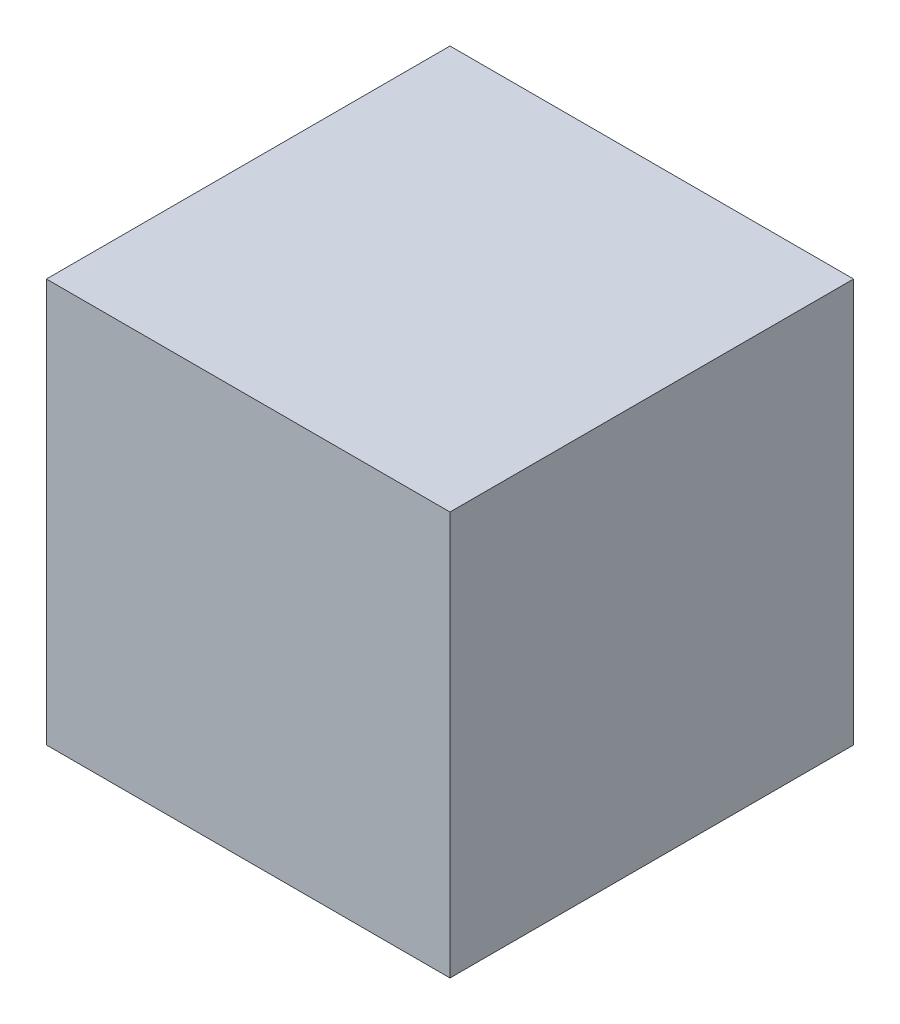
ISO-10303-21;
HEADER;
FILE_DESCRIPTION(('STEP AP214'),'2;1');
FILE_NAME('part.step','',(''),(''),'','','');
FILE_SCHEMA(('AUTOMOTIVE_DESIGN { 1 0 10303 214 1 1 1 1 }'));
ENDSEC;
DATA;
#1=APPLICATION_CONTEXT('core data for automotive mechanical design processes');
#2=APPLICATION_PROTOCOL_DEFINITION('international standard','automotive_design',2000,#1);
#3=PRODUCT_CONTEXT('',#1,'mechanical');
#4=PRODUCT('Part','Part','',(#3));
#5=PRODUCT_RELATED_PRODUCT_CATEGORY('part','',(#4));
#6=PRODUCT_DEFINITION_FORMATION('','',#4);
#7=PRODUCT_DEFINITION_CONTEXT('part definition',#1,'design');
#8=PRODUCT_DEFINITION('design','',#6,#7);
#9=PRODUCT_DEFINITION_SHAPE('','',#8);
#10=(LENGTH_UNIT() NAMED_UNIT(*) SI_UNIT(.MILLI.,.METRE.));
#11=(NAMED_UNIT(*) PLANE_ANGLE_UNIT() SI_UNIT($,.RADIAN.));
#12=(NAMED_UNIT(*) SI_UNIT($,.STERADIAN.) SOLID_ANGLE_UNIT());
#13=UNCERTAINTY_MEASURE_WITH_UNIT(LENGTH_MEASURE(1.E-05),#10,'distance_accuracy_value','');
#14=(GEOMETRIC_REPRESENTATION_CONTEXT(3) GLOBAL_UNCERTAINTY_ASSIGNED_CONTEXT((#13)) GLOBAL_UNIT_ASSIGNED_CONTEXT((#10,
#11,#12)) REPRESENTATION_CONTEXT('',''));
#15=CARTESIAN_POINT('',(0.,0.,0.));
#16=DIRECTION('',(0.,0.,1.));
#17=DIRECTION('',(1.,0.,0.));
#18=AXIS2_PLACEMENT_3D('',#15,#16,#17);
#19=CARTESIAN_POINT('',(0.,12.7,0.));
#20=DIRECTION('',(-1.,0.,0.));
#21=DIRECTION('',(0.,0.,1.));
#22=AXIS2_PLACEMENT_3D('',#19,#20,#21);
#23=PLANE('',#22);
#24=DIRECTION('',(0.,0.,-1.));
#25=VECTOR('',#24,1.);
#26=CARTESIAN_POINT('',(0.,0.,0.));
#27=LINE('',#26,#25);
#28=CARTESIAN_POINT('',(0.,0.,0.));
#29=VERTEX_POINT('',#28);
#30=CARTESIAN_POINT('',(0.,0.,-12.7));
#31=VERTEX_POINT('',#30);
#32=EDGE_CURVE('E98',#29,#31,#27,.T.);
#33=ORIENTED_EDGE('',*,*,#32,.F.);
#34=DIRECTION('',(0.,-1.,0.));
#35=VECTOR('',#34,1.);
#36=CARTESIAN_POINT('',(0.,12.7,0.));
#37=LINE('',#36,#35);
#38=CARTESIAN_POINT('',(0.,12.7,0.));
#39=VERTEX_POINT('',#38);
#40=EDGE_CURVE('E11',#39,#29,#37,.T.);
#41=ORIENTED_EDGE('',*,*,#40,.F.);
#42=DIRECTION('',(0.,0.,-1.));
#43=VECTOR('',#42,1.);
#44=CARTESIAN_POINT('',(0.,12.7,0.));
#45=LINE('',#44,#43);
#46=CARTESIAN_POINT('',(0.,12.7,-12.7));
#47=VERTEX_POINT('',#46);
#48=EDGE_CURVE('E93',#39,#47,#45,.T.);
#49=ORIENTED_EDGE('',*,*,#48,.T.);
#50=DIRECTION('',(0.,-1.,0.));
#51=VECTOR('',#50,1.);
#52=CARTESIAN_POINT('',(0.,12.7,-12.7));
#53=LINE('',#52,#51);
#54=EDGE_CURVE('E36',#47,#31,#53,.T.);
#55=ORIENTED_EDGE('',*,*,#54,.T.);
#56=EDGE_LOOP('',(#33,#41,#49,#55));
#57=FACE_BOUND('',#56,.T.);
#58=ADVANCED_FACE('F33',(#57),#23,.T.);
#59=CARTESIAN_POINT('',(0.,12.7,0.));
#60=DIRECTION('',(0.,0.,-1.));
#61=DIRECTION('',(-1.,0.,0.));
#62=AXIS2_PLACEMENT_3D('',#59,#60,#61);
#63=PLANE('',#62);
#64=DIRECTION('',(1.,0.,0.));
#65=VECTOR('',#64,1.);
#66=CARTESIAN_POINT('',(0.,0.,0.));
#67=LINE('',#66,#65);
#68=CARTESIAN_POINT('',(12.7,0.,0.));
#69=VERTEX_POINT('',#68);
#70=EDGE_CURVE('E66',#29,#69,#67,.T.);
#71=ORIENTED_EDGE('',*,*,#70,.T.);
#72=DIRECTION('',(0.,-1.,0.));
#73=VECTOR('',#72,1.);
#74=CARTESIAN_POINT('',(12.7,12.7,0.));
#75=LINE('',#74,#73);
#76=CARTESIAN_POINT('',(12.7,12.7,0.));
#77=VERTEX_POINT('',#76);
#78=EDGE_CURVE('E42',#77,#69,#75,.T.);
#79=ORIENTED_EDGE('',*,*,#78,.F.);
#80=DIRECTION('',(1.,0.,0.));
#81=VECTOR('',#80,1.);
#82=CARTESIAN_POINT('',(0.,12.7,0.));
#83=LINE('',#82,#81);
#84=EDGE_CURVE('E83',#39,#77,#83,.T.);
#85=ORIENTED_EDGE('',*,*,#84,.F.);
#86=ORIENTED_EDGE('',*,*,#40,.T.);
#87=EDGE_LOOP('',(#71,#79,#85,#86));
#88=FACE_BOUND('',#87,.T.);
#89=ADVANCED_FACE('F108',(#88),#63,.F.);
#90=CARTESIAN_POINT('',(12.7,12.7,0.));
#91=DIRECTION('',(-1.,0.,0.));
#92=DIRECTION('',(0.,0.,1.));
#93=AXIS2_PLACEMENT_3D('',#90,#91,#92);
#94=PLANE('',#93);
#95=DIRECTION('',(0.,0.,-1.));
#96=VECTOR('',#95,1.);
#97=CARTESIAN_POINT('',(12.7,0.,0.));
#98=LINE('',#97,#96);
#99=CARTESIAN_POINT('',(12.7,0.,-12.7));
#100=VERTEX_POINT('',#99);
#101=EDGE_CURVE('E90',#69,#100,#98,.T.);
#102=ORIENTED_EDGE('',*,*,#101,.T.);
#103=DIRECTION('',(0.,-1.,0.));
#104=VECTOR('',#103,1.);
#105=CARTESIAN_POINT('',(12.7,12.7,-12.7));
#106=LINE('',#105,#104);
#107=CARTESIAN_POINT('',(12.7,12.7,-12.7));
#108=VERTEX_POINT('',#107);
#109=EDGE_CURVE('E87',#108,#100,#106,.T.);
#110=ORIENTED_EDGE('',*,*,#109,.F.);
#111=DIRECTION('',(0.,0.,-1.));
#112=VECTOR('',#111,1.);
#113=CARTESIAN_POINT('',(12.7,12.7,0.));
#114=LINE('',#113,#112);
#115=EDGE_CURVE('E78',#77,#108,#114,.T.);
#116=ORIENTED_EDGE('',*,*,#115,.F.);
#117=ORIENTED_EDGE('',*,*,#78,.T.);
#118=EDGE_LOOP('',(#102,#110,#116,#117));
#119=FACE_BOUND('',#118,.T.);
#120=ADVANCED_FACE('F88',(#119),#94,.F.);
#121=CARTESIAN_POINT('',(0.,12.7,-12.7));
#122=DIRECTION('',(0.,0.,-1.));
#123=DIRECTION('',(-1.,0.,0.));
#124=AXIS2_PLACEMENT_3D('',#121,#122,#123);
#125=PLANE('',#124);
#126=DIRECTION('',(1.,0.,0.));
#127=VECTOR('',#126,1.);
#128=CARTESIAN_POINT('',(0.,0.,-12.7));
#129=LINE('',#128,#127);
#130=EDGE_CURVE('E101',#31,#100,#129,.T.);
#131=ORIENTED_EDGE('',*,*,#130,.F.);
#132=ORIENTED_EDGE('',*,*,#54,.F.);
#133=DIRECTION('',(1.,0.,0.));
#134=VECTOR('',#133,1.);
#135=CARTESIAN_POINT('',(0.,12.7,-12.7));
#136=LINE('',#135,#134);
#137=EDGE_CURVE('E82',#47,#108,#136,.T.);
#138=ORIENTED_EDGE('',*,*,#137,.T.);
#139=ORIENTED_EDGE('',*,*,#109,.T.);
#140=EDGE_LOOP('',(#131,#132,#138,#139));
#141=FACE_BOUND('',#140,.T.);
#142=ADVANCED_FACE('F92',(#141),#125,.T.);
#143=CARTESIAN_POINT('',(0.,12.7,0.));
#144=DIRECTION('',(0.,-1.,0.));
#145=DIRECTION('',(0.,0.,-1.));
#146=AXIS2_PLACEMENT_3D('',#143,#144,#145);
#147=PLANE('',#146);
#148=ORIENTED_EDGE('',*,*,#48,.F.);
#149=ORIENTED_EDGE('',*,*,#84,.T.);
#150=ORIENTED_EDGE('',*,*,#115,.T.);
#151=ORIENTED_EDGE('',*,*,#137,.F.);
#152=EDGE_LOOP('',(#148,#149,#150,#151));
#153=FACE_BOUND('',#152,.T.);
#154=ADVANCED_FACE('F81',(#153),#147,.F.);
#155=CARTESIAN_POINT('',(0.,0.,0.));
#156=DIRECTION('',(0.,-1.,0.));
#157=DIRECTION('',(0.,0.,-1.));
#158=AXIS2_PLACEMENT_3D('',#155,#156,#157);
#159=PLANE('',#158);
#160=ORIENTED_EDGE('',*,*,#32,.T.);
#161=ORIENTED_EDGE('',*,*,#130,.T.);
#162=ORIENTED_EDGE('',*,*,#101,.F.);
#163=ORIENTED_EDGE('',*,*,#70,.F.);
#164=EDGE_LOOP('',(#160,#161,#162,#163));
#165=FACE_BOUND('',#164,.T.);
#166=ADVANCED_FACE('F106',(#165),#159,.T.);
#167=CLOSED_SHELL('',(#58,#89,#120,#142,#154,#166));
#168=MANIFOLD_SOLID_BREP('B2',#167);
#169=ADVANCED_BREP_SHAPE_REPRESENTATION('',(#18,#168),#14);
#170=SHAPE_DEFINITION_REPRESENTATION(#9,#169);
ENDSEC;
END-ISO-10303-21;
